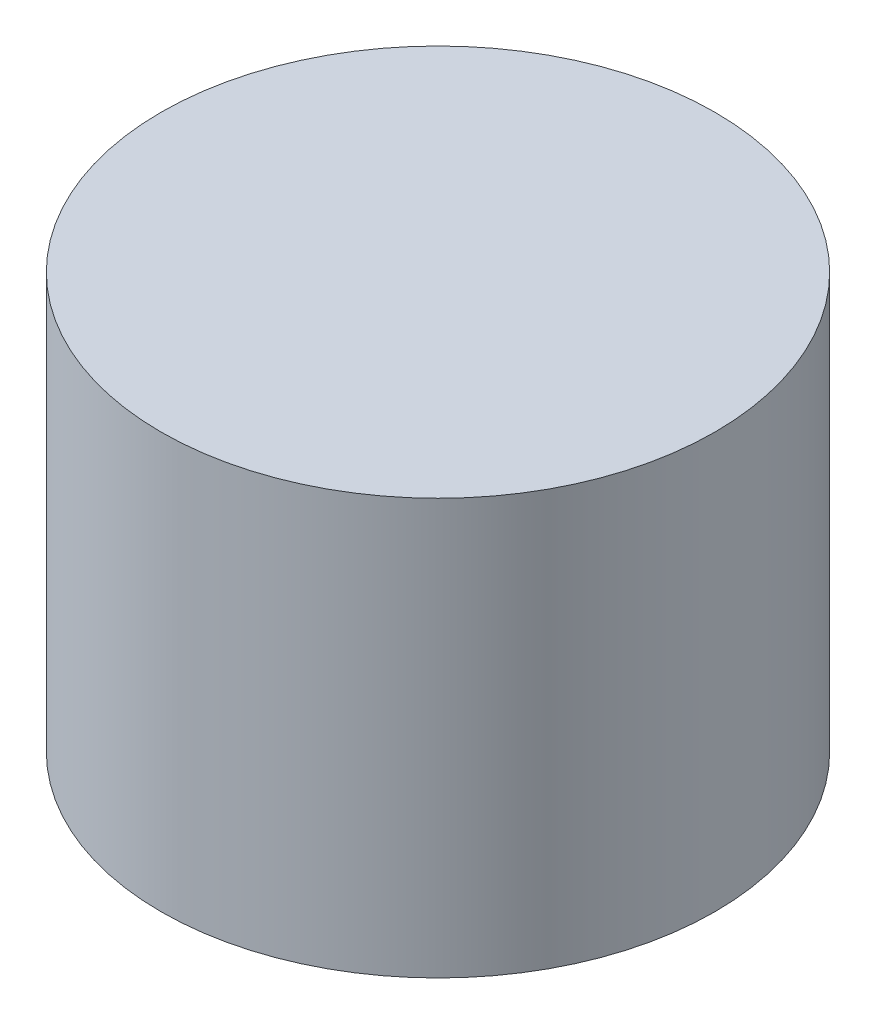
ISO-10303-21;
HEADER;
FILE_DESCRIPTION(('STEP AP214'),'2;1');
FILE_NAME('part.step','',(''),(''),'','','');
FILE_SCHEMA(('AUTOMOTIVE_DESIGN { 1 0 10303 214 1 1 1 1 }'));
ENDSEC;
DATA;
#1=APPLICATION_CONTEXT('core data for automotive mechanical design processes');
#2=APPLICATION_PROTOCOL_DEFINITION('international standard','automotive_design',2000,#1);
#3=PRODUCT_CONTEXT('',#1,'mechanical');
#4=PRODUCT('Part','Part','',(#3));
#5=PRODUCT_RELATED_PRODUCT_CATEGORY('part','',(#4));
#6=PRODUCT_DEFINITION_FORMATION('','',#4);
#7=PRODUCT_DEFINITION_CONTEXT('part definition',#1,'design');
#8=PRODUCT_DEFINITION('design','',#6,#7);
#9=PRODUCT_DEFINITION_SHAPE('','',#8);
#10=(LENGTH_UNIT() NAMED_UNIT(*) SI_UNIT(.MILLI.,.METRE.));
#11=(NAMED_UNIT(*) PLANE_ANGLE_UNIT() SI_UNIT($,.RADIAN.));
#12=(NAMED_UNIT(*) SI_UNIT($,.STERADIAN.) SOLID_ANGLE_UNIT());
#13=UNCERTAINTY_MEASURE_WITH_UNIT(LENGTH_MEASURE(1.E-05),#10,'distance_accuracy_value','');
#14=(GEOMETRIC_REPRESENTATION_CONTEXT(3) GLOBAL_UNCERTAINTY_ASSIGNED_CONTEXT((#13)) GLOBAL_UNIT_ASSIGNED_CONTEXT((#10,
#11,#12)) REPRESENTATION_CONTEXT('',''));
#15=CARTESIAN_POINT('',(0.,0.,0.));
#16=DIRECTION('',(0.,0.,1.));
#17=DIRECTION('',(1.,0.,0.));
#18=AXIS2_PLACEMENT_3D('',#15,#16,#17);
#19=CARTESIAN_POINT('',(0.,5.25,0.));
#20=DIRECTION('',(0.,-1.,0.));
#21=DIRECTION('',(0.,0.,-1.));
#22=AXIS2_PLACEMENT_3D('',#19,#20,#21);
#23=CYLINDRICAL_SURFACE('',#22,3.5);
#24=CARTESIAN_POINT('',(0.,5.25,0.));
#25=DIRECTION('',(0.,1.,0.));
#26=DIRECTION('',(0.,0.,1.));
#27=AXIS2_PLACEMENT_3D('',#24,#25,#26);
#28=CIRCLE('',#27,3.5);
#29=CARTESIAN_POINT('',(0.,5.25,3.5));
#30=VERTEX_POINT('',#29);
#31=EDGE_CURVE('E10',#30,#30,#28,.T.);
#32=ORIENTED_EDGE('',*,*,#31,.F.);
#33=EDGE_LOOP('',(#32));
#34=FACE_BOUND('',#33,.T.);
#35=CARTESIAN_POINT('',(0.,0.,0.));
#36=DIRECTION('',(0.,1.,0.));
#37=DIRECTION('',(0.,0.,1.));
#38=AXIS2_PLACEMENT_3D('',#35,#36,#37);
#39=CIRCLE('',#38,3.5);
#40=CARTESIAN_POINT('',(0.,0.,3.5));
#41=VERTEX_POINT('',#40);
#42=EDGE_CURVE('E34',#41,#41,#39,.T.);
#43=ORIENTED_EDGE('',*,*,#42,.T.);
#44=EDGE_LOOP('',(#43));
#45=FACE_BOUND('',#44,.T.);
#46=ADVANCED_FACE('F31',(#34,#45),#23,.T.);
#47=CARTESIAN_POINT('',(0.,5.25,0.));
#48=DIRECTION('',(0.,1.,0.));
#49=DIRECTION('',(0.,0.,1.));
#50=AXIS2_PLACEMENT_3D('',#47,#48,#49);
#51=PLANE('',#50);
#52=ORIENTED_EDGE('',*,*,#31,.T.);
#53=EDGE_LOOP('',(#52));
#54=FACE_BOUND('',#53,.T.);
#55=ADVANCED_FACE('F46',(#54),#51,.T.);
#56=CARTESIAN_POINT('',(0.,0.,0.));
#57=DIRECTION('',(0.,1.,0.));
#58=DIRECTION('',(0.,0.,1.));
#59=AXIS2_PLACEMENT_3D('',#56,#57,#58);
#60=PLANE('',#59);
#61=ORIENTED_EDGE('',*,*,#42,.F.);
#62=EDGE_LOOP('',(#61));
#63=FACE_BOUND('',#62,.T.);
#64=ADVANCED_FACE('F44',(#63),#60,.F.);
#65=CLOSED_SHELL('',(#46,#55,#64));
#66=MANIFOLD_SOLID_BREP('B2',#65);
#67=ADVANCED_BREP_SHAPE_REPRESENTATION('',(#18,#66),#14);
#68=SHAPE_DEFINITION_REPRESENTATION(#9,#67);
ENDSEC;
END-ISO-10303-21;
